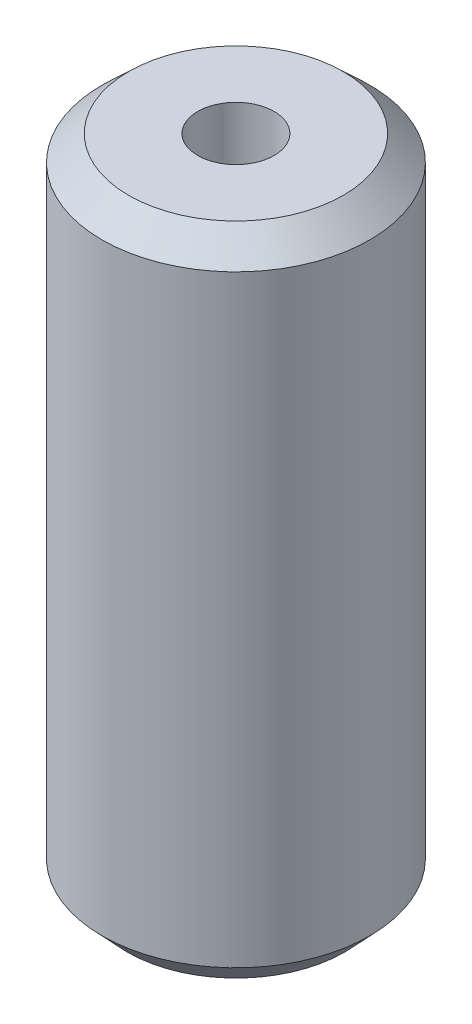
ISO-10303-21;
HEADER;
FILE_DESCRIPTION(('STEP AP214'),'2;1');
FILE_NAME('part.step','',(''),(''),'','','');
FILE_SCHEMA(('AUTOMOTIVE_DESIGN { 1 0 10303 214 1 1 1 1 }'));
ENDSEC;
DATA;
#1=APPLICATION_CONTEXT('core data for automotive mechanical design processes');
#2=APPLICATION_PROTOCOL_DEFINITION('international standard','automotive_design',2000,#1);
#3=PRODUCT_CONTEXT('',#1,'mechanical');
#4=PRODUCT('Part','Part','',(#3));
#5=PRODUCT_RELATED_PRODUCT_CATEGORY('part','',(#4));
#6=PRODUCT_DEFINITION_FORMATION('','',#4);
#7=PRODUCT_DEFINITION_CONTEXT('part definition',#1,'design');
#8=PRODUCT_DEFINITION('design','',#6,#7);
#9=PRODUCT_DEFINITION_SHAPE('','',#8);
#10=(LENGTH_UNIT() NAMED_UNIT(*) SI_UNIT(.MILLI.,.METRE.));
#11=(NAMED_UNIT(*) PLANE_ANGLE_UNIT() SI_UNIT($,.RADIAN.));
#12=(NAMED_UNIT(*) SI_UNIT($,.STERADIAN.) SOLID_ANGLE_UNIT());
#13=UNCERTAINTY_MEASURE_WITH_UNIT(LENGTH_MEASURE(1.E-05),#10,'distance_accuracy_value','');
#14=(GEOMETRIC_REPRESENTATION_CONTEXT(3) GLOBAL_UNCERTAINTY_ASSIGNED_CONTEXT((#13)) GLOBAL_UNIT_ASSIGNED_CONTEXT((#10,
#11,#12)) REPRESENTATION_CONTEXT('',''));
#15=CARTESIAN_POINT('',(0.,0.,0.));
#16=DIRECTION('',(0.,0.,1.));
#17=DIRECTION('',(1.,0.,0.));
#18=AXIS2_PLACEMENT_3D('',#15,#16,#17);
#19=CARTESIAN_POINT('',(0.,109.928357075806,0.));
#20=DIRECTION('',(0.,-1.,0.));
#21=DIRECTION('',(0.,0.,-1.));
#22=AXIS2_PLACEMENT_3D('',#19,#20,#21);
#23=CYLINDRICAL_SURFACE('',#22,22.5);
#24=CARTESIAN_POINT('',(0.,105.705568213924,0.));
#25=DIRECTION('',(0.,1.,0.));
#26=DIRECTION('',(0.,0.,1.));
#27=AXIS2_PLACEMENT_3D('',#24,#25,#26);
#28=CIRCLE('',#27,22.5);
#29=CARTESIAN_POINT('',(0.,105.705568213924,22.5));
#30=VERTEX_POINT('',#29);
#31=EDGE_CURVE('E50',#30,#30,#28,.F.);
#32=ORIENTED_EDGE('',*,*,#31,.T.);
#33=EDGE_LOOP('',(#32));
#34=FACE_BOUND('',#33,.T.);
#35=CARTESIAN_POINT('',(0.,4.48257112600491,0.));
#36=DIRECTION('',(0.,1.,0.));
#37=DIRECTION('',(0.,0.,1.));
#38=AXIS2_PLACEMENT_3D('',#35,#36,#37);
#39=CIRCLE('',#38,22.5);
#40=CARTESIAN_POINT('',(0.,4.48257112600491,22.5));
#41=VERTEX_POINT('',#40);
#42=EDGE_CURVE('E51',#41,#41,#39,.T.);
#43=ORIENTED_EDGE('',*,*,#42,.T.);
#44=EDGE_LOOP('',(#43));
#45=FACE_BOUND('',#44,.T.);
#46=ADVANCED_FACE('F39',(#34,#45),#23,.T.);
#47=CARTESIAN_POINT('',(0.,109.928357075806,0.));
#48=DIRECTION('',(0.,1.,0.));
#49=DIRECTION('',(0.,0.,1.));
#50=AXIS2_PLACEMENT_3D('',#47,#48,#49);
#51=PLANE('',#50);
#52=CARTESIAN_POINT('',(0.,109.928357075806,0.));
#53=DIRECTION('',(0.,1.,0.));
#54=DIRECTION('',(0.,0.,1.));
#55=AXIS2_PLACEMENT_3D('',#52,#53,#54);
#56=CIRCLE('',#55,18.0174288739951);
#57=CARTESIAN_POINT('',(0.,109.928357075806,18.0174288739951));
#58=VERTEX_POINT('',#57);
#59=EDGE_CURVE('E54',#58,#58,#56,.T.);
#60=ORIENTED_EDGE('',*,*,#59,.T.);
#61=EDGE_LOOP('',(#60));
#62=FACE_BOUND('',#61,.T.);
#63=CARTESIAN_POINT('',(0.,109.928357075806,0.));
#64=DIRECTION('',(0.,1.,0.));
#65=DIRECTION('',(0.,0.,1.));
#66=AXIS2_PLACEMENT_3D('',#63,#64,#65);
#67=CIRCLE('',#66,6.41375212486336);
#68=CARTESIAN_POINT('',(0.,109.928357075806,6.41375212486336));
#69=VERTEX_POINT('',#68);
#70=EDGE_CURVE('E58',#69,#69,#67,.T.);
#71=ORIENTED_EDGE('',*,*,#70,.F.);
#72=EDGE_LOOP('',(#71));
#73=FACE_BOUND('',#72,.T.);
#74=ADVANCED_FACE('F69',(#62,#73),#51,.T.);
#75=CARTESIAN_POINT('',(0.,0.,0.));
#76=DIRECTION('',(0.,1.,0.));
#77=DIRECTION('',(0.,0.,1.));
#78=AXIS2_PLACEMENT_3D('',#75,#76,#77);
#79=PLANE('',#78);
#80=CARTESIAN_POINT('',(0.,0.,0.));
#81=DIRECTION('',(0.,1.,0.));
#82=DIRECTION('',(0.,0.,1.));
#83=AXIS2_PLACEMENT_3D('',#80,#81,#82);
#84=CIRCLE('',#83,18.2772111381182);
#85=CARTESIAN_POINT('',(0.,0.,18.2772111381182));
#86=VERTEX_POINT('',#85);
#87=EDGE_CURVE('E10',#86,#86,#84,.F.);
#88=ORIENTED_EDGE('',*,*,#87,.T.);
#89=EDGE_LOOP('',(#88));
#90=FACE_BOUND('',#89,.T.);
#91=CARTESIAN_POINT('',(0.,0.,0.));
#92=DIRECTION('',(0.,1.,0.));
#93=DIRECTION('',(0.,0.,1.));
#94=AXIS2_PLACEMENT_3D('',#91,#92,#93);
#95=CIRCLE('',#94,6.41375212486336);
#96=CARTESIAN_POINT('',(0.,0.,6.41375212486336));
#97=VERTEX_POINT('',#96);
#98=EDGE_CURVE('E63',#97,#97,#95,.T.);
#99=ORIENTED_EDGE('',*,*,#98,.T.);
#100=EDGE_LOOP('',(#99));
#101=FACE_BOUND('',#100,.T.);
#102=ADVANCED_FACE('F75',(#90,#101),#79,.F.);
#103=CARTESIAN_POINT('',(0.,109.928357075806,0.));
#104=DIRECTION('',(0.,-1.,0.));
#105=DIRECTION('',(0.,0.,-1.));
#106=AXIS2_PLACEMENT_3D('',#103,#104,#105);
#107=CYLINDRICAL_SURFACE('',#106,6.41375212486336);
#108=ORIENTED_EDGE('',*,*,#70,.T.);
#109=EDGE_LOOP('',(#108));
#110=FACE_BOUND('',#109,.T.);
#111=ORIENTED_EDGE('',*,*,#98,.F.);
#112=EDGE_LOOP('',(#111));
#113=FACE_BOUND('',#112,.T.);
#114=ADVANCED_FACE('F70',(#110,#113),#107,.F.);
#115=CARTESIAN_POINT('',(0.,109.928357075806,0.));
#116=DIRECTION('',(0.,-1.,0.));
#117=DIRECTION('',(0.,0.,-1.));
#118=AXIS2_PLACEMENT_3D('',#115,#116,#117);
#119=CONICAL_SURFACE('',#118,18.0174288739951,0.815230955098898);
#120=ORIENTED_EDGE('',*,*,#31,.F.);
#121=EDGE_LOOP('',(#120));
#122=FACE_BOUND('',#121,.T.);
#123=ORIENTED_EDGE('',*,*,#59,.F.);
#124=EDGE_LOOP('',(#123));
#125=FACE_BOUND('',#124,.T.);
#126=ADVANCED_FACE('F81',(#122,#125),#119,.T.);
#127=CARTESIAN_POINT('',(0.,4.48257112600491,0.));
#128=DIRECTION('',(0.,1.,0.));
#129=DIRECTION('',(0.,0.,1.));
#130=AXIS2_PLACEMENT_3D('',#127,#128,#129);
#131=CONICAL_SURFACE('',#130,22.5,0.755565371696);
#132=ORIENTED_EDGE('',*,*,#87,.F.);
#133=EDGE_LOOP('',(#132));
#134=FACE_BOUND('',#133,.T.);
#135=ORIENTED_EDGE('',*,*,#42,.F.);
#136=EDGE_LOOP('',(#135));
#137=FACE_BOUND('',#136,.T.);
#138=ADVANCED_FACE('F45',(#134,#137),#131,.T.);
#139=CLOSED_SHELL('',(#46,#74,#102,#114,#126,#138));
#140=MANIFOLD_SOLID_BREP('B2',#139);
#141=ADVANCED_BREP_SHAPE_REPRESENTATION('',(#18,#140),#14);
#142=SHAPE_DEFINITION_REPRESENTATION(#9,#141);
ENDSEC;
END-ISO-10303-21;
